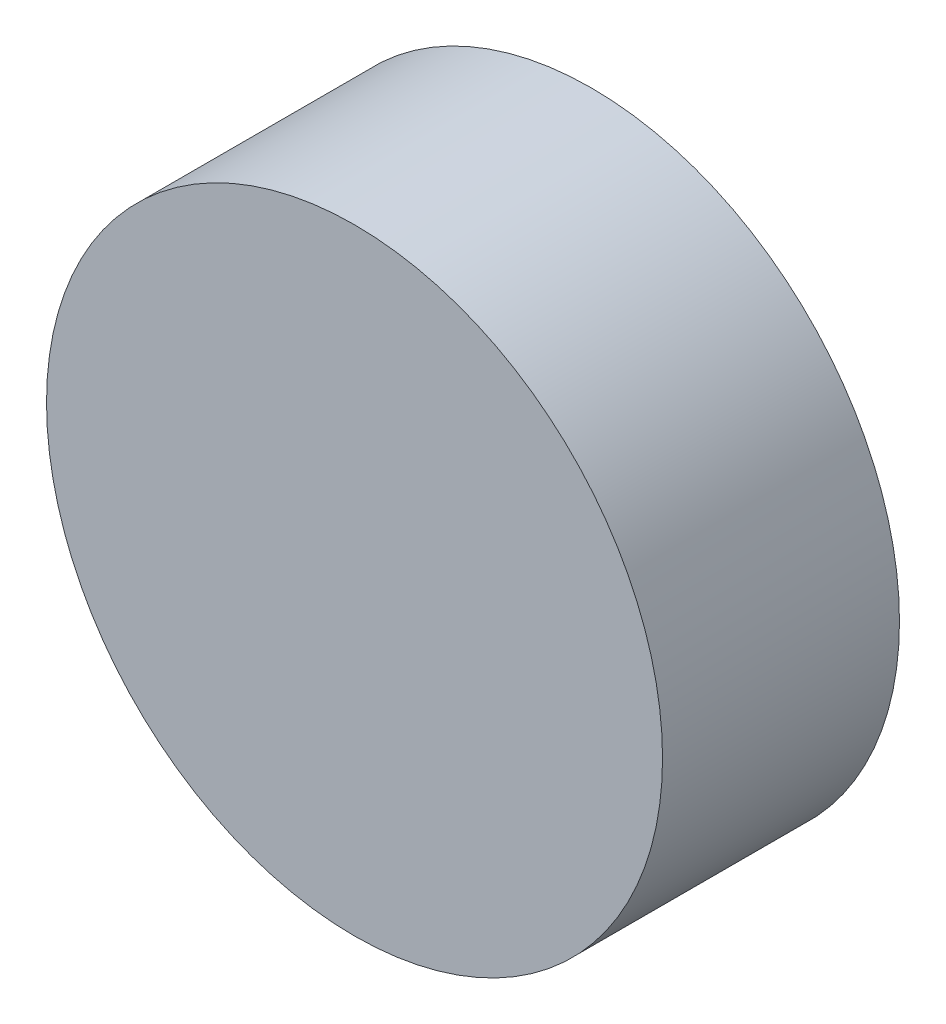
ISO-10303-21;
HEADER;
FILE_DESCRIPTION(('STEP AP214'),'2;1');
FILE_NAME('part.step','',(''),(''),'','','');
FILE_SCHEMA(('AUTOMOTIVE_DESIGN { 1 0 10303 214 1 1 1 1 }'));
ENDSEC;
DATA;
#1=APPLICATION_CONTEXT('core data for automotive mechanical design processes');
#2=APPLICATION_PROTOCOL_DEFINITION('international standard','automotive_design',2000,#1);
#3=PRODUCT_CONTEXT('',#1,'mechanical');
#4=PRODUCT('Part','Part','',(#3));
#5=PRODUCT_RELATED_PRODUCT_CATEGORY('part','',(#4));
#6=PRODUCT_DEFINITION_FORMATION('','',#4);
#7=PRODUCT_DEFINITION_CONTEXT('part definition',#1,'design');
#8=PRODUCT_DEFINITION('design','',#6,#7);
#9=PRODUCT_DEFINITION_SHAPE('','',#8);
#10=(LENGTH_UNIT() NAMED_UNIT(*) SI_UNIT(.MILLI.,.METRE.));
#11=(NAMED_UNIT(*) PLANE_ANGLE_UNIT() SI_UNIT($,.RADIAN.));
#12=(NAMED_UNIT(*) SI_UNIT($,.STERADIAN.) SOLID_ANGLE_UNIT());
#13=UNCERTAINTY_MEASURE_WITH_UNIT(LENGTH_MEASURE(1.E-05),#10,'distance_accuracy_value','');
#14=(GEOMETRIC_REPRESENTATION_CONTEXT(3) GLOBAL_UNCERTAINTY_ASSIGNED_CONTEXT((#13)) GLOBAL_UNIT_ASSIGNED_CONTEXT((#10,
#11,#12)) REPRESENTATION_CONTEXT('',''));
#15=CARTESIAN_POINT('',(0.,0.,0.));
#16=DIRECTION('',(0.,0.,1.));
#17=DIRECTION('',(1.,0.,0.));
#18=AXIS2_PLACEMENT_3D('',#15,#16,#17);
#19=CARTESIAN_POINT('',(0.,0.,-25.4));
#20=DIRECTION('',(0.,0.,1.));
#21=DIRECTION('',(1.,0.,0.));
#22=AXIS2_PLACEMENT_3D('',#19,#20,#21);
#23=CYLINDRICAL_SURFACE('',#22,33.02);
#24=CARTESIAN_POINT('',(0.,0.,-25.4));
#25=DIRECTION('',(0.,0.,1.));
#26=DIRECTION('',(1.,0.,0.));
#27=AXIS2_PLACEMENT_3D('',#24,#25,#26);
#28=CIRCLE('',#27,33.02);
#29=CARTESIAN_POINT('',(33.02,0.,-25.4));
#30=VERTEX_POINT('',#29);
#31=EDGE_CURVE('E10',#30,#30,#28,.T.);
#32=ORIENTED_EDGE('',*,*,#31,.T.);
#33=EDGE_LOOP('',(#32));
#34=FACE_BOUND('',#33,.T.);
#35=CARTESIAN_POINT('',(0.,0.,0.));
#36=DIRECTION('',(0.,0.,1.));
#37=DIRECTION('',(1.,0.,0.));
#38=AXIS2_PLACEMENT_3D('',#35,#36,#37);
#39=CIRCLE('',#38,33.02);
#40=CARTESIAN_POINT('',(33.02,0.,0.));
#41=VERTEX_POINT('',#40);
#42=EDGE_CURVE('E39',#41,#41,#39,.T.);
#43=ORIENTED_EDGE('',*,*,#42,.F.);
#44=EDGE_LOOP('',(#43));
#45=FACE_BOUND('',#44,.T.);
#46=ADVANCED_FACE('F36',(#34,#45),#23,.T.);
#47=CARTESIAN_POINT('',(0.,0.,-25.4));
#48=DIRECTION('',(0.,0.,1.));
#49=DIRECTION('',(1.,0.,0.));
#50=AXIS2_PLACEMENT_3D('',#47,#48,#49);
#51=PLANE('',#50);
#52=CARTESIAN_POINT('',(0.,0.,-25.4));
#53=DIRECTION('',(0.,0.,-1.));
#54=DIRECTION('',(-1.,0.,0.));
#55=AXIS2_PLACEMENT_3D('',#52,#53,#54);
#56=CIRCLE('',#55,2.54);
#57=CARTESIAN_POINT('',(-2.54,0.,-25.4));
#58=VERTEX_POINT('',#57);
#59=EDGE_CURVE('E50',#58,#58,#56,.T.);
#60=ORIENTED_EDGE('',*,*,#59,.F.);
#61=EDGE_LOOP('',(#60));
#62=FACE_BOUND('',#61,.T.);
#63=ORIENTED_EDGE('',*,*,#31,.F.);
#64=EDGE_LOOP('',(#63));
#65=FACE_BOUND('',#64,.T.);
#66=ADVANCED_FACE('F67',(#62,#65),#51,.F.);
#67=CARTESIAN_POINT('',(0.,0.,0.));
#68=DIRECTION('',(0.,0.,1.));
#69=DIRECTION('',(1.,0.,0.));
#70=AXIS2_PLACEMENT_3D('',#67,#68,#69);
#71=PLANE('',#70);
#72=ORIENTED_EDGE('',*,*,#42,.T.);
#73=EDGE_LOOP('',(#72));
#74=FACE_BOUND('',#73,.T.);
#75=ADVANCED_FACE('F63',(#74),#71,.T.);
#76=CARTESIAN_POINT('',(0.,0.,-16.51));
#77=DIRECTION('',(0.,0.,-1.));
#78=DIRECTION('',(-1.,0.,0.));
#79=AXIS2_PLACEMENT_3D('',#76,#77,#78);
#80=CYLINDRICAL_SURFACE('',#79,2.54);
#81=CARTESIAN_POINT('',(0.,0.,-16.51));
#82=DIRECTION('',(0.,0.,-1.));
#83=DIRECTION('',(-1.,0.,0.));
#84=AXIS2_PLACEMENT_3D('',#81,#82,#83);
#85=CIRCLE('',#84,2.54);
#86=CARTESIAN_POINT('',(-2.54,0.,-16.51));
#87=VERTEX_POINT('',#86);
#88=EDGE_CURVE('E48',#87,#87,#85,.T.);
#89=ORIENTED_EDGE('',*,*,#88,.F.);
#90=EDGE_LOOP('',(#89));
#91=FACE_BOUND('',#90,.T.);
#92=ORIENTED_EDGE('',*,*,#59,.T.);
#93=EDGE_LOOP('',(#92));
#94=FACE_BOUND('',#93,.T.);
#95=ADVANCED_FACE('F60',(#91,#94),#80,.F.);
#96=CARTESIAN_POINT('',(0.,0.,-16.51));
#97=DIRECTION('',(0.,0.,-1.));
#98=DIRECTION('',(-1.,0.,0.));
#99=AXIS2_PLACEMENT_3D('',#96,#97,#98);
#100=PLANE('',#99);
#101=ORIENTED_EDGE('',*,*,#88,.T.);
#102=EDGE_LOOP('',(#101));
#103=FACE_BOUND('',#102,.T.);
#104=ADVANCED_FACE('F58',(#103),#100,.T.);
#105=CLOSED_SHELL('',(#46,#66,#75,#95,#104));
#106=MANIFOLD_SOLID_BREP('B2',#105);
#107=ADVANCED_BREP_SHAPE_REPRESENTATION('',(#18,#106),#14);
#108=SHAPE_DEFINITION_REPRESENTATION(#9,#107);
ENDSEC;
END-ISO-10303-21;
